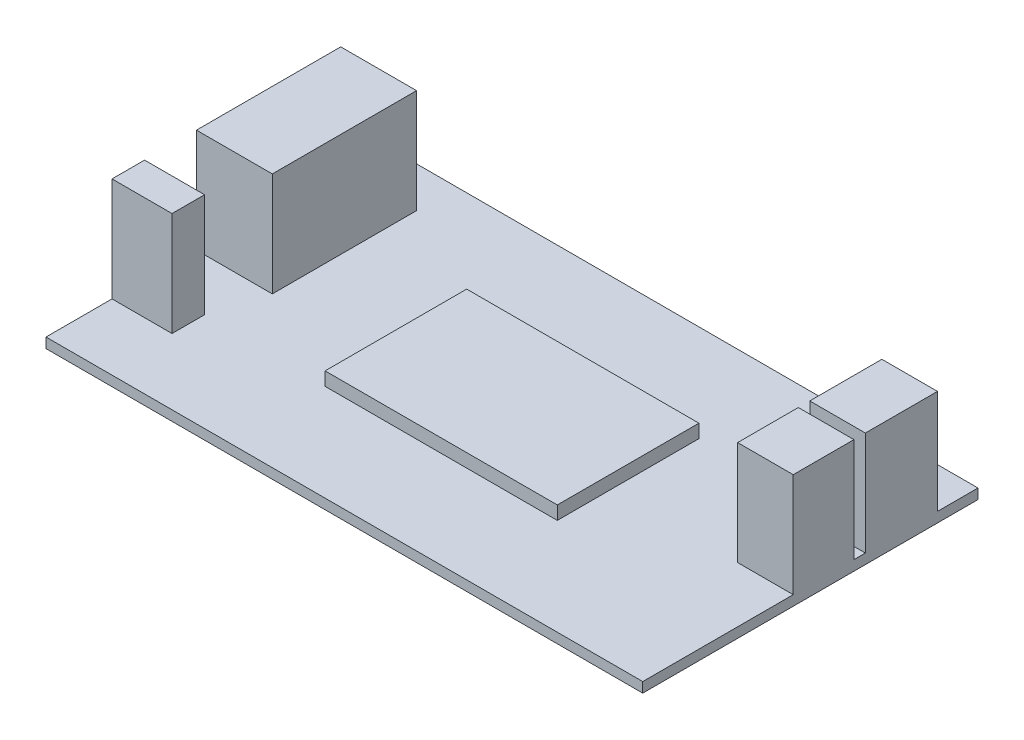
ISO-10303-21;
HEADER;
FILE_DESCRIPTION(('STEP AP214'),'2;1');
FILE_NAME('part.step','',(''),(''),'','','');
FILE_SCHEMA(('AUTOMOTIVE_DESIGN { 1 0 10303 214 1 1 1 1 }'));
ENDSEC;
DATA;
#1=APPLICATION_CONTEXT('core data for automotive mechanical design processes');
#2=APPLICATION_PROTOCOL_DEFINITION('international standard','automotive_design',2000,#1);
#3=PRODUCT_CONTEXT('',#1,'mechanical');
#4=PRODUCT('Part','Part','',(#3));
#5=PRODUCT_RELATED_PRODUCT_CATEGORY('part','',(#4));
#6=PRODUCT_DEFINITION_FORMATION('','',#4);
#7=PRODUCT_DEFINITION_CONTEXT('part definition',#1,'design');
#8=PRODUCT_DEFINITION('design','',#6,#7);
#9=PRODUCT_DEFINITION_SHAPE('','',#8);
#10=(LENGTH_UNIT() NAMED_UNIT(*) SI_UNIT(.MILLI.,.METRE.));
#11=(NAMED_UNIT(*) PLANE_ANGLE_UNIT() SI_UNIT($,.RADIAN.));
#12=(NAMED_UNIT(*) SI_UNIT($,.STERADIAN.) SOLID_ANGLE_UNIT());
#13=UNCERTAINTY_MEASURE_WITH_UNIT(LENGTH_MEASURE(1.E-05),#10,'distance_accuracy_value','');
#14=(GEOMETRIC_REPRESENTATION_CONTEXT(3) GLOBAL_UNCERTAINTY_ASSIGNED_CONTEXT((#13)) GLOBAL_UNIT_ASSIGNED_CONTEXT((#10,
#11,#12)) REPRESENTATION_CONTEXT('',''));
#15=CARTESIAN_POINT('',(0.,0.,0.));
#16=DIRECTION('',(0.,0.,1.));
#17=DIRECTION('',(1.,0.,0.));
#18=AXIS2_PLACEMENT_3D('',#15,#16,#17);
#19=CARTESIAN_POINT('',(0.,1.5,0.));
#20=DIRECTION('',(0.,1.,0.));
#21=DIRECTION('',(0.,0.,1.));
#22=AXIS2_PLACEMENT_3D('',#19,#20,#21);
#23=PLANE('',#22);
#24=DIRECTION('',(0.,0.,1.));
#25=VECTOR('',#24,1.);
#26=CARTESIAN_POINT('',(36.2079849627216,1.5,-6.49382339005333));
#27=LINE('',#26,#25);
#28=CARTESIAN_POINT('',(36.2079849627216,1.5,-6.49382339005333));
#29=VERTEX_POINT('',#28);
#30=CARTESIAN_POINT('',(36.2079849627216,1.5,2.55817285062705));
#31=VERTEX_POINT('',#30);
#32=EDGE_CURVE('E59',#29,#31,#27,.T.);
#33=ORIENTED_EDGE('',*,*,#32,.F.);
#34=DIRECTION('',(-1.,0.,0.));
#35=VECTOR('',#34,1.);
#36=CARTESIAN_POINT('',(44.5,1.5,-6.49382339005333));
#37=LINE('',#36,#35);
#38=CARTESIAN_POINT('',(44.5,1.5,-6.49382339005333));
#39=VERTEX_POINT('',#38);
#40=EDGE_CURVE('E223',#39,#29,#37,.T.);
#41=ORIENTED_EDGE('',*,*,#40,.F.);
#42=DIRECTION('',(0.,0.,-1.));
#43=VECTOR('',#42,1.);
#44=CARTESIAN_POINT('',(44.5,1.5,-25.));
#45=LINE('',#44,#43);
#46=CARTESIAN_POINT('',(44.5,1.5,-8.19927195713806));
#47=VERTEX_POINT('',#46);
#48=EDGE_CURVE('E357',#39,#47,#45,.T.);
#49=ORIENTED_EDGE('',*,*,#48,.T.);
#50=DIRECTION('',(1.,0.,0.));
#51=VECTOR('',#50,1.);
#52=CARTESIAN_POINT('',(44.5,1.5,-8.19927195713805));
#53=LINE('',#52,#51);
#54=CARTESIAN_POINT('',(36.2079849627216,1.5,-8.19927195713805));
#55=VERTEX_POINT('',#54);
#56=EDGE_CURVE('E259',#55,#47,#53,.T.);
#57=ORIENTED_EDGE('',*,*,#56,.F.);
#58=DIRECTION('',(0.,0.,1.));
#59=VECTOR('',#58,1.);
#60=CARTESIAN_POINT('',(36.2079849627216,1.5,-18.9567167649031));
#61=LINE('',#60,#59);
#62=CARTESIAN_POINT('',(36.2079849627216,1.5,-18.9567167649031));
#63=VERTEX_POINT('',#62);
#64=EDGE_CURVE('E268',#63,#55,#61,.T.);
#65=ORIENTED_EDGE('',*,*,#64,.F.);
#66=DIRECTION('',(-1.,0.,0.));
#67=VECTOR('',#66,1.);
#68=CARTESIAN_POINT('',(44.5,1.5,-18.9567167649031));
#69=LINE('',#68,#67);
#70=CARTESIAN_POINT('',(44.5,1.5,-18.9567167649031));
#71=VERTEX_POINT('',#70);
#72=EDGE_CURVE('E254',#71,#63,#69,.T.);
#73=ORIENTED_EDGE('',*,*,#72,.F.);
#74=CARTESIAN_POINT('',(44.5,1.5,-25.));
#75=VERTEX_POINT('',#74);
#76=EDGE_CURVE('E358',#71,#75,#45,.T.);
#77=ORIENTED_EDGE('',*,*,#76,.T.);
#78=DIRECTION('',(-1.,0.,0.));
#79=VECTOR('',#78,1.);
#80=CARTESIAN_POINT('',(-44.5,1.5,-25.));
#81=LINE('',#80,#79);
#82=CARTESIAN_POINT('',(-44.5,1.5,-25.));
#83=VERTEX_POINT('',#82);
#84=EDGE_CURVE('E356',#75,#83,#81,.T.);
#85=ORIENTED_EDGE('',*,*,#84,.T.);
#86=DIRECTION('',(0.,0.,1.));
#87=VECTOR('',#86,1.);
#88=CARTESIAN_POINT('',(-44.5,1.5,-25.));
#89=LINE('',#88,#87);
#90=CARTESIAN_POINT('',(-44.5,1.5,-18.9567167649032));
#91=VERTEX_POINT('',#90);
#92=EDGE_CURVE('E369',#83,#91,#89,.T.);
#93=ORIENTED_EDGE('',*,*,#92,.T.);
#94=DIRECTION('',(-1.,0.,0.));
#95=VECTOR('',#94,1.);
#96=CARTESIAN_POINT('',(-44.5,1.5,-18.9567167649032));
#97=LINE('',#96,#95);
#98=CARTESIAN_POINT('',(-33.1906528824948,1.5,-18.9567167649032));
#99=VERTEX_POINT('',#98);
#100=EDGE_CURVE('E315',#99,#91,#97,.T.);
#101=ORIENTED_EDGE('',*,*,#100,.F.);
#102=DIRECTION('',(0.,0.,-1.));
#103=VECTOR('',#102,1.);
#104=CARTESIAN_POINT('',(-33.1906528824948,1.5,-18.9567167649032));
#105=LINE('',#104,#103);
#106=CARTESIAN_POINT('',(-33.1906528824948,1.5,2.55817285062705));
#107=VERTEX_POINT('',#106);
#108=EDGE_CURVE('E322',#107,#99,#105,.T.);
#109=ORIENTED_EDGE('',*,*,#108,.F.);
#110=DIRECTION('',(1.,0.,0.));
#111=VECTOR('',#110,1.);
#112=CARTESIAN_POINT('',(-44.5,1.5,2.55817285062705));
#113=LINE('',#112,#111);
#114=CARTESIAN_POINT('',(-44.5,1.5,2.55817285062704));
#115=VERTEX_POINT('',#114);
#116=EDGE_CURVE('E310',#115,#107,#113,.T.);
#117=ORIENTED_EDGE('',*,*,#116,.F.);
#118=CARTESIAN_POINT('',(-44.5,1.5,10.2982855781654));
#119=VERTEX_POINT('',#118);
#120=EDGE_CURVE('E366',#115,#119,#89,.T.);
#121=ORIENTED_EDGE('',*,*,#120,.T.);
#122=DIRECTION('',(-1.,0.,0.));
#123=VECTOR('',#122,1.);
#124=CARTESIAN_POINT('',(-44.5,1.5,10.2982855781654));
#125=LINE('',#124,#123);
#126=CARTESIAN_POINT('',(-35.5520432061505,1.5,10.2982855781654));
#127=VERTEX_POINT('',#126);
#128=EDGE_CURVE('E289',#127,#119,#125,.T.);
#129=ORIENTED_EDGE('',*,*,#128,.F.);
#130=DIRECTION('',(0.,0.,-1.));
#131=VECTOR('',#130,1.);
#132=CARTESIAN_POINT('',(-35.5520432061505,1.5,10.2982855781654));
#133=LINE('',#132,#131);
#134=CARTESIAN_POINT('',(-35.5520432061505,1.5,15.1522545767911));
#135=VERTEX_POINT('',#134);
#136=EDGE_CURVE('E297',#135,#127,#133,.T.);
#137=ORIENTED_EDGE('',*,*,#136,.F.);
#138=DIRECTION('',(1.,0.,0.));
#139=VECTOR('',#138,1.);
#140=CARTESIAN_POINT('',(-44.5,1.5,15.1522545767911));
#141=LINE('',#140,#139);
#142=CARTESIAN_POINT('',(-44.5,1.5,15.1522545767911));
#143=VERTEX_POINT('',#142);
#144=EDGE_CURVE('E284',#143,#135,#141,.T.);
#145=ORIENTED_EDGE('',*,*,#144,.F.);
#146=CARTESIAN_POINT('',(-44.5,1.5,25.));
#147=VERTEX_POINT('',#146);
#148=EDGE_CURVE('E37',#143,#147,#89,.T.);
#149=ORIENTED_EDGE('',*,*,#148,.T.);
#150=DIRECTION('',(1.,0.,0.));
#151=VECTOR('',#150,1.);
#152=CARTESIAN_POINT('',(-44.5,1.5,25.));
#153=LINE('',#152,#151);
#154=CARTESIAN_POINT('',(44.5,1.5,25.));
#155=VERTEX_POINT('',#154);
#156=EDGE_CURVE('E361',#147,#155,#153,.T.);
#157=ORIENTED_EDGE('',*,*,#156,.T.);
#158=CARTESIAN_POINT('',(44.5,1.5,2.55817285062705));
#159=VERTEX_POINT('',#158);
#160=EDGE_CURVE('E354',#155,#159,#45,.T.);
#161=ORIENTED_EDGE('',*,*,#160,.T.);
#162=DIRECTION('',(1.,0.,0.));
#163=VECTOR('',#162,1.);
#164=CARTESIAN_POINT('',(44.5,1.5,2.55817285062705));
#165=LINE('',#164,#163);
#166=EDGE_CURVE('E233',#31,#159,#165,.T.);
#167=ORIENTED_EDGE('',*,*,#166,.F.);
#168=EDGE_LOOP('',(#33,#41,#49,#57,#65,#73,#77,#85,#93,#101,#109,#117,#121,#129,#137,#145,#149,
#157,#161,#167));
#169=FACE_BOUND('',#168,.T.);
#170=DIRECTION('',(-1.,0.,0.));
#171=VECTOR('',#170,1.);
#172=CARTESIAN_POINT('',(-17.3168471020499,1.5,-10.5606557137502));
#173=LINE('',#172,#171);
#174=CARTESIAN_POINT('',(17.3168471020499,1.5,-10.5606557137502));
#175=VERTEX_POINT('',#174);
#176=CARTESIAN_POINT('',(-17.3168471020499,1.5,-10.5606557137502));
#177=VERTEX_POINT('',#176);
#178=EDGE_CURVE('E638',#175,#177,#173,.T.);
#179=ORIENTED_EDGE('',*,*,#178,.F.);
#180=DIRECTION('',(0.,0.,-1.));
#181=VECTOR('',#180,1.);
#182=CARTESIAN_POINT('',(17.3168471020499,1.5,-10.5606557137502));
#183=LINE('',#182,#181);
#184=CARTESIAN_POINT('',(17.3168471020499,1.5,10.5606557137502));
#185=VERTEX_POINT('',#184);
#186=EDGE_CURVE('E221',#185,#175,#183,.T.);
#187=ORIENTED_EDGE('',*,*,#186,.F.);
#188=DIRECTION('',(1.,0.,0.));
#189=VECTOR('',#188,1.);
#190=CARTESIAN_POINT('',(-17.3168471020499,1.5,10.5606557137502));
#191=LINE('',#190,#189);
#192=CARTESIAN_POINT('',(-17.3168471020499,1.5,10.5606557137502));
#193=VERTEX_POINT('',#192);
#194=EDGE_CURVE('E217',#193,#185,#191,.T.);
#195=ORIENTED_EDGE('',*,*,#194,.F.);
#196=DIRECTION('',(0.,0.,1.));
#197=VECTOR('',#196,1.);
#198=CARTESIAN_POINT('',(-17.3168471020499,1.5,-10.5606557137502));
#199=LINE('',#198,#197);
#200=EDGE_CURVE('E635',#177,#193,#199,.T.);
#201=ORIENTED_EDGE('',*,*,#200,.F.);
#202=EDGE_LOOP('',(#179,#187,#195,#201));
#203=FACE_BOUND('',#202,.T.);
#204=ADVANCED_FACE('F33',(#169,#203),#23,.T.);
#205=CARTESIAN_POINT('',(44.5,1.5,-25.));
#206=DIRECTION('',(-1.,0.,0.));
#207=DIRECTION('',(0.,0.,1.));
#208=AXIS2_PLACEMENT_3D('',#205,#206,#207);
#209=PLANE('',#208);
#210=DIRECTION('',(0.,0.,-1.));
#211=VECTOR('',#210,1.);
#212=CARTESIAN_POINT('',(44.5,0.,-25.));
#213=LINE('',#212,#211);
#214=CARTESIAN_POINT('',(44.5,0.,25.));
#215=VERTEX_POINT('',#214);
#216=CARTESIAN_POINT('',(44.5,0.,-25.));
#217=VERTEX_POINT('',#216);
#218=EDGE_CURVE('E352',#215,#217,#213,.T.);
#219=ORIENTED_EDGE('',*,*,#218,.T.);
#220=DIRECTION('',(0.,-1.,0.));
#221=VECTOR('',#220,1.);
#222=CARTESIAN_POINT('',(44.5,1.5,-25.));
#223=LINE('',#222,#221);
#224=EDGE_CURVE('E11',#75,#217,#223,.T.);
#225=ORIENTED_EDGE('',*,*,#224,.F.);
#226=ORIENTED_EDGE('',*,*,#76,.F.);
#227=DIRECTION('',(0.,-1.,0.));
#228=VECTOR('',#227,1.);
#229=CARTESIAN_POINT('',(44.5,17.,-18.9567167649031));
#230=LINE('',#229,#228);
#231=CARTESIAN_POINT('',(44.5,17.,-18.9567167649031));
#232=VERTEX_POINT('',#231);
#233=EDGE_CURVE('E281',#232,#71,#230,.T.);
#234=ORIENTED_EDGE('',*,*,#233,.F.);
#235=DIRECTION('',(0.,0.,-1.));
#236=VECTOR('',#235,1.);
#237=CARTESIAN_POINT('',(44.5,17.,-18.9567167649031));
#238=LINE('',#237,#236);
#239=CARTESIAN_POINT('',(44.5,17.,-8.19927195713805));
#240=VERTEX_POINT('',#239);
#241=EDGE_CURVE('E255',#240,#232,#238,.T.);
#242=ORIENTED_EDGE('',*,*,#241,.F.);
#243=DIRECTION('',(0.,-1.,0.));
#244=VECTOR('',#243,1.);
#245=CARTESIAN_POINT('',(44.5,17.,-8.19927195713805));
#246=LINE('',#245,#244);
#247=EDGE_CURVE('E265',#240,#47,#246,.T.);
#248=ORIENTED_EDGE('',*,*,#247,.T.);
#249=ORIENTED_EDGE('',*,*,#48,.F.);
#250=DIRECTION('',(0.,-1.,0.));
#251=VECTOR('',#250,1.);
#252=CARTESIAN_POINT('',(44.5,17.,-6.49382339005333));
#253=LINE('',#252,#251);
#254=CARTESIAN_POINT('',(44.5,17.,-6.49382339005333));
#255=VERTEX_POINT('',#254);
#256=EDGE_CURVE('E251',#255,#39,#253,.T.);
#257=ORIENTED_EDGE('',*,*,#256,.F.);
#258=DIRECTION('',(0.,0.,-1.));
#259=VECTOR('',#258,1.);
#260=CARTESIAN_POINT('',(44.5,17.,-6.49382339005333));
#261=LINE('',#260,#259);
#262=CARTESIAN_POINT('',(44.5,17.,2.55817285062705));
#263=VERTEX_POINT('',#262);
#264=EDGE_CURVE('E229',#263,#255,#261,.T.);
#265=ORIENTED_EDGE('',*,*,#264,.F.);
#266=DIRECTION('',(0.,-1.,0.));
#267=VECTOR('',#266,1.);
#268=CARTESIAN_POINT('',(44.5,17.,2.55817285062705));
#269=LINE('',#268,#267);
#270=EDGE_CURVE('E238',#263,#159,#269,.T.);
#271=ORIENTED_EDGE('',*,*,#270,.T.);
#272=ORIENTED_EDGE('',*,*,#160,.F.);
#273=DIRECTION('',(0.,-1.,0.));
#274=VECTOR('',#273,1.);
#275=CARTESIAN_POINT('',(44.5,1.5,25.));
#276=LINE('',#275,#274);
#277=EDGE_CURVE('E376',#155,#215,#276,.T.);
#278=ORIENTED_EDGE('',*,*,#277,.T.);
#279=EDGE_LOOP('',(#219,#225,#226,#234,#242,#248,#249,#257,#265,#271,#272,#278));
#280=FACE_BOUND('',#279,.T.);
#281=ADVANCED_FACE('F35',(#280),#209,.F.);
#282=CARTESIAN_POINT('',(-44.5,1.5,-25.));
#283=DIRECTION('',(0.,0.,1.));
#284=DIRECTION('',(1.,0.,0.));
#285=AXIS2_PLACEMENT_3D('',#282,#283,#284);
#286=PLANE('',#285);
#287=DIRECTION('',(-1.,0.,0.));
#288=VECTOR('',#287,1.);
#289=CARTESIAN_POINT('',(-44.5,0.,-25.));
#290=LINE('',#289,#288);
#291=CARTESIAN_POINT('',(-44.5,0.,-25.));
#292=VERTEX_POINT('',#291);
#293=EDGE_CURVE('E383',#217,#292,#290,.T.);
#294=ORIENTED_EDGE('',*,*,#293,.T.);
#295=DIRECTION('',(0.,-1.,0.));
#296=VECTOR('',#295,1.);
#297=CARTESIAN_POINT('',(-44.5,1.5,-25.));
#298=LINE('',#297,#296);
#299=EDGE_CURVE('E43',#83,#292,#298,.T.);
#300=ORIENTED_EDGE('',*,*,#299,.F.);
#301=ORIENTED_EDGE('',*,*,#84,.F.);
#302=ORIENTED_EDGE('',*,*,#224,.T.);
#303=EDGE_LOOP('',(#294,#300,#301,#302));
#304=FACE_BOUND('',#303,.T.);
#305=ADVANCED_FACE('F397',(#304),#286,.F.);
#306=CARTESIAN_POINT('',(-44.5,1.5,-25.));
#307=DIRECTION('',(1.,0.,0.));
#308=DIRECTION('',(0.,0.,-1.));
#309=AXIS2_PLACEMENT_3D('',#306,#307,#308);
#310=PLANE('',#309);
#311=DIRECTION('',(0.,0.,1.));
#312=VECTOR('',#311,1.);
#313=CARTESIAN_POINT('',(-44.5,0.,-25.));
#314=LINE('',#313,#312);
#315=CARTESIAN_POINT('',(-44.5,0.,25.));
#316=VERTEX_POINT('',#315);
#317=EDGE_CURVE('E381',#292,#316,#314,.T.);
#318=ORIENTED_EDGE('',*,*,#317,.T.);
#319=DIRECTION('',(0.,-1.,0.));
#320=VECTOR('',#319,1.);
#321=CARTESIAN_POINT('',(-44.5,1.5,25.));
#322=LINE('',#321,#320);
#323=EDGE_CURVE('E373',#147,#316,#322,.T.);
#324=ORIENTED_EDGE('',*,*,#323,.F.);
#325=ORIENTED_EDGE('',*,*,#148,.F.);
#326=DIRECTION('',(0.,-1.,0.));
#327=VECTOR('',#326,1.);
#328=CARTESIAN_POINT('',(-44.5,17.,15.1522545767911));
#329=LINE('',#328,#327);
#330=CARTESIAN_POINT('',(-44.5,17.,15.1522545767911));
#331=VERTEX_POINT('',#330);
#332=EDGE_CURVE('E308',#331,#143,#329,.T.);
#333=ORIENTED_EDGE('',*,*,#332,.F.);
#334=DIRECTION('',(0.,0.,1.));
#335=VECTOR('',#334,1.);
#336=CARTESIAN_POINT('',(-44.5,17.,10.2982855781654));
#337=LINE('',#336,#335);
#338=CARTESIAN_POINT('',(-44.5,17.,10.2982855781654));
#339=VERTEX_POINT('',#338);
#340=EDGE_CURVE('E285',#339,#331,#337,.T.);
#341=ORIENTED_EDGE('',*,*,#340,.F.);
#342=DIRECTION('',(0.,-1.,0.));
#343=VECTOR('',#342,1.);
#344=CARTESIAN_POINT('',(-44.5,17.,10.2982855781654));
#345=LINE('',#344,#343);
#346=EDGE_CURVE('E295',#339,#119,#345,.T.);
#347=ORIENTED_EDGE('',*,*,#346,.T.);
#348=ORIENTED_EDGE('',*,*,#120,.F.);
#349=DIRECTION('',(0.,-1.,0.));
#350=VECTOR('',#349,1.);
#351=CARTESIAN_POINT('',(-44.5,17.,2.55817285062705));
#352=LINE('',#351,#350);
#353=CARTESIAN_POINT('',(-44.5,17.,2.55817285062705));
#354=VERTEX_POINT('',#353);
#355=EDGE_CURVE('E347',#354,#115,#352,.T.);
#356=ORIENTED_EDGE('',*,*,#355,.F.);
#357=DIRECTION('',(0.,0.,1.));
#358=VECTOR('',#357,1.);
#359=CARTESIAN_POINT('',(-44.5,17.,-18.9567167649032));
#360=LINE('',#359,#358);
#361=CARTESIAN_POINT('',(-44.5,17.,-18.9567167649032));
#362=VERTEX_POINT('',#361);
#363=EDGE_CURVE('E311',#362,#354,#360,.T.);
#364=ORIENTED_EDGE('',*,*,#363,.F.);
#365=DIRECTION('',(0.,-1.,0.));
#366=VECTOR('',#365,1.);
#367=CARTESIAN_POINT('',(-44.5,17.,-18.9567167649032));
#368=LINE('',#367,#366);
#369=EDGE_CURVE('E321',#362,#91,#368,.T.);
#370=ORIENTED_EDGE('',*,*,#369,.T.);
#371=ORIENTED_EDGE('',*,*,#92,.F.);
#372=ORIENTED_EDGE('',*,*,#299,.T.);
#373=EDGE_LOOP('',(#318,#324,#325,#333,#341,#347,#348,#356,#364,#370,#371,#372));
#374=FACE_BOUND('',#373,.T.);
#375=ADVANCED_FACE('F441',(#374),#310,.F.);
#376=CARTESIAN_POINT('',(-44.5,1.5,25.));
#377=DIRECTION('',(0.,0.,-1.));
#378=DIRECTION('',(-1.,0.,0.));
#379=AXIS2_PLACEMENT_3D('',#376,#377,#378);
#380=PLANE('',#379);
#381=DIRECTION('',(1.,0.,0.));
#382=VECTOR('',#381,1.);
#383=CARTESIAN_POINT('',(-44.5,0.,25.));
#384=LINE('',#383,#382);
#385=EDGE_CURVE('E379',#316,#215,#384,.T.);
#386=ORIENTED_EDGE('',*,*,#385,.T.);
#387=ORIENTED_EDGE('',*,*,#277,.F.);
#388=ORIENTED_EDGE('',*,*,#156,.F.);
#389=ORIENTED_EDGE('',*,*,#323,.T.);
#390=EDGE_LOOP('',(#386,#387,#388,#389));
#391=FACE_BOUND('',#390,.T.);
#392=ADVANCED_FACE('F438',(#391),#380,.F.);
#393=CARTESIAN_POINT('',(0.,0.,0.));
#394=DIRECTION('',(0.,1.,0.));
#395=DIRECTION('',(0.,0.,1.));
#396=AXIS2_PLACEMENT_3D('',#393,#394,#395);
#397=PLANE('',#396);
#398=ORIENTED_EDGE('',*,*,#218,.F.);
#399=ORIENTED_EDGE('',*,*,#385,.F.);
#400=ORIENTED_EDGE('',*,*,#317,.F.);
#401=ORIENTED_EDGE('',*,*,#293,.F.);
#402=EDGE_LOOP('',(#398,#399,#400,#401));
#403=FACE_BOUND('',#402,.T.);
#404=ADVANCED_FACE('F392',(#403),#397,.F.);
#405=CARTESIAN_POINT('',(-44.5,17.,2.55817285062705));
#406=DIRECTION('',(0.,0.,-1.));
#407=DIRECTION('',(-1.,0.,0.));
#408=AXIS2_PLACEMENT_3D('',#405,#406,#407);
#409=PLANE('',#408);
#410=ORIENTED_EDGE('',*,*,#116,.T.);
#411=DIRECTION('',(0.,-1.,0.));
#412=VECTOR('',#411,1.);
#413=CARTESIAN_POINT('',(-33.1906528824948,17.,2.55817285062705));
#414=LINE('',#413,#412);
#415=CARTESIAN_POINT('',(-33.1906528824948,17.,2.55817285062705));
#416=VERTEX_POINT('',#415);
#417=EDGE_CURVE('E342',#416,#107,#414,.T.);
#418=ORIENTED_EDGE('',*,*,#417,.F.);
#419=DIRECTION('',(1.,0.,0.));
#420=VECTOR('',#419,1.);
#421=CARTESIAN_POINT('',(-44.5,17.,2.55817285062705));
#422=LINE('',#421,#420);
#423=EDGE_CURVE('E314',#354,#416,#422,.T.);
#424=ORIENTED_EDGE('',*,*,#423,.F.);
#425=ORIENTED_EDGE('',*,*,#355,.T.);
#426=EDGE_LOOP('',(#410,#418,#424,#425));
#427=FACE_BOUND('',#426,.T.);
#428=ADVANCED_FACE('F434',(#427),#409,.F.);
#429=CARTESIAN_POINT('',(-33.1906528824948,17.,-18.9567167649032));
#430=DIRECTION('',(-1.,0.,0.));
#431=DIRECTION('',(0.,0.,1.));
#432=AXIS2_PLACEMENT_3D('',#429,#430,#431);
#433=PLANE('',#432);
#434=ORIENTED_EDGE('',*,*,#108,.T.);
#435=DIRECTION('',(0.,-1.,0.));
#436=VECTOR('',#435,1.);
#437=CARTESIAN_POINT('',(-33.1906528824948,17.,-18.9567167649032));
#438=LINE('',#437,#436);
#439=CARTESIAN_POINT('',(-33.1906528824948,17.,-18.9567167649032));
#440=VERTEX_POINT('',#439);
#441=EDGE_CURVE('E327',#440,#99,#438,.T.);
#442=ORIENTED_EDGE('',*,*,#441,.F.);
#443=DIRECTION('',(0.,0.,-1.));
#444=VECTOR('',#443,1.);
#445=CARTESIAN_POINT('',(-33.1906528824948,17.,-18.9567167649032));
#446=LINE('',#445,#444);
#447=EDGE_CURVE('E317',#416,#440,#446,.T.);
#448=ORIENTED_EDGE('',*,*,#447,.F.);
#449=ORIENTED_EDGE('',*,*,#417,.T.);
#450=EDGE_LOOP('',(#434,#442,#448,#449));
#451=FACE_BOUND('',#450,.T.);
#452=ADVANCED_FACE('F467',(#451),#433,.F.);
#453=CARTESIAN_POINT('',(-44.5,17.,-18.9567167649032));
#454=DIRECTION('',(0.,0.,1.));
#455=DIRECTION('',(1.,0.,0.));
#456=AXIS2_PLACEMENT_3D('',#453,#454,#455);
#457=PLANE('',#456);
#458=ORIENTED_EDGE('',*,*,#100,.T.);
#459=ORIENTED_EDGE('',*,*,#369,.F.);
#460=DIRECTION('',(-1.,0.,0.));
#461=VECTOR('',#460,1.);
#462=CARTESIAN_POINT('',(-44.5,17.,-18.9567167649032));
#463=LINE('',#462,#461);
#464=EDGE_CURVE('E319',#440,#362,#463,.T.);
#465=ORIENTED_EDGE('',*,*,#464,.F.);
#466=ORIENTED_EDGE('',*,*,#441,.T.);
#467=EDGE_LOOP('',(#458,#459,#465,#466));
#468=FACE_BOUND('',#467,.T.);
#469=ADVANCED_FACE('F474',(#468),#457,.F.);
#470=CARTESIAN_POINT('',(0.,17.,0.));
#471=DIRECTION('',(0.,1.,0.));
#472=DIRECTION('',(0.,0.,1.));
#473=AXIS2_PLACEMENT_3D('',#470,#471,#472);
#474=PLANE('',#473);
#475=ORIENTED_EDGE('',*,*,#363,.T.);
#476=ORIENTED_EDGE('',*,*,#423,.T.);
#477=ORIENTED_EDGE('',*,*,#447,.T.);
#478=ORIENTED_EDGE('',*,*,#464,.T.);
#479=EDGE_LOOP('',(#475,#476,#477,#478));
#480=FACE_BOUND('',#479,.T.);
#481=ADVANCED_FACE('F480',(#480),#474,.T.);
#482=CARTESIAN_POINT('',(-44.5,17.,15.1522545767911));
#483=DIRECTION('',(0.,0.,-1.));
#484=DIRECTION('',(-1.,0.,0.));
#485=AXIS2_PLACEMENT_3D('',#482,#483,#484);
#486=PLANE('',#485);
#487=ORIENTED_EDGE('',*,*,#144,.T.);
#488=DIRECTION('',(0.,-1.,0.));
#489=VECTOR('',#488,1.);
#490=CARTESIAN_POINT('',(-35.5520432061505,17.,15.1522545767911));
#491=LINE('',#490,#489);
#492=CARTESIAN_POINT('',(-35.5520432061505,17.,15.1522545767911));
#493=VERTEX_POINT('',#492);
#494=EDGE_CURVE('E305',#493,#135,#491,.T.);
#495=ORIENTED_EDGE('',*,*,#494,.F.);
#496=DIRECTION('',(1.,0.,0.));
#497=VECTOR('',#496,1.);
#498=CARTESIAN_POINT('',(-44.5,17.,15.1522545767911));
#499=LINE('',#498,#497);
#500=EDGE_CURVE('E288',#331,#493,#499,.T.);
#501=ORIENTED_EDGE('',*,*,#500,.F.);
#502=ORIENTED_EDGE('',*,*,#332,.T.);
#503=EDGE_LOOP('',(#487,#495,#501,#502));
#504=FACE_BOUND('',#503,.T.);
#505=ADVANCED_FACE('F487',(#504),#486,.F.);
#506=CARTESIAN_POINT('',(-35.5520432061505,17.,10.2982855781654));
#507=DIRECTION('',(-1.,0.,0.));
#508=DIRECTION('',(0.,0.,1.));
#509=AXIS2_PLACEMENT_3D('',#506,#507,#508);
#510=PLANE('',#509);
#511=ORIENTED_EDGE('',*,*,#136,.T.);
#512=DIRECTION('',(0.,-1.,0.));
#513=VECTOR('',#512,1.);
#514=CARTESIAN_POINT('',(-35.5520432061505,17.,10.2982855781654));
#515=LINE('',#514,#513);
#516=CARTESIAN_POINT('',(-35.5520432061505,17.,10.2982855781654));
#517=VERTEX_POINT('',#516);
#518=EDGE_CURVE('E303',#517,#127,#515,.T.);
#519=ORIENTED_EDGE('',*,*,#518,.F.);
#520=DIRECTION('',(0.,0.,-1.));
#521=VECTOR('',#520,1.);
#522=CARTESIAN_POINT('',(-35.5520432061505,17.,10.2982855781654));
#523=LINE('',#522,#521);
#524=EDGE_CURVE('E291',#493,#517,#523,.T.);
#525=ORIENTED_EDGE('',*,*,#524,.F.);
#526=ORIENTED_EDGE('',*,*,#494,.T.);
#527=EDGE_LOOP('',(#511,#519,#525,#526));
#528=FACE_BOUND('',#527,.T.);
#529=ADVANCED_FACE('F495',(#528),#510,.F.);
#530=CARTESIAN_POINT('',(-44.5,17.,10.2982855781654));
#531=DIRECTION('',(0.,0.,1.));
#532=DIRECTION('',(1.,0.,0.));
#533=AXIS2_PLACEMENT_3D('',#530,#531,#532);
#534=PLANE('',#533);
#535=ORIENTED_EDGE('',*,*,#128,.T.);
#536=ORIENTED_EDGE('',*,*,#346,.F.);
#537=DIRECTION('',(-1.,0.,0.));
#538=VECTOR('',#537,1.);
#539=CARTESIAN_POINT('',(-44.5,17.,10.2982855781654));
#540=LINE('',#539,#538);
#541=EDGE_CURVE('E293',#517,#339,#540,.T.);
#542=ORIENTED_EDGE('',*,*,#541,.F.);
#543=ORIENTED_EDGE('',*,*,#518,.T.);
#544=EDGE_LOOP('',(#535,#536,#542,#543));
#545=FACE_BOUND('',#544,.T.);
#546=ADVANCED_FACE('F424',(#545),#534,.F.);
#547=CARTESIAN_POINT('',(0.,17.,0.));
#548=DIRECTION('',(0.,1.,0.));
#549=DIRECTION('',(0.,0.,1.));
#550=AXIS2_PLACEMENT_3D('',#547,#548,#549);
#551=PLANE('',#550);
#552=ORIENTED_EDGE('',*,*,#340,.T.);
#553=ORIENTED_EDGE('',*,*,#500,.T.);
#554=ORIENTED_EDGE('',*,*,#524,.T.);
#555=ORIENTED_EDGE('',*,*,#541,.T.);
#556=EDGE_LOOP('',(#552,#553,#554,#555));
#557=FACE_BOUND('',#556,.T.);
#558=ADVANCED_FACE('F417',(#557),#551,.T.);
#559=CARTESIAN_POINT('',(44.5,17.,-18.9567167649031));
#560=DIRECTION('',(0.,0.,1.));
#561=DIRECTION('',(1.,0.,0.));
#562=AXIS2_PLACEMENT_3D('',#559,#560,#561);
#563=PLANE('',#562);
#564=ORIENTED_EDGE('',*,*,#72,.T.);
#565=DIRECTION('',(0.,-1.,0.));
#566=VECTOR('',#565,1.);
#567=CARTESIAN_POINT('',(36.2079849627216,17.,-18.9567167649031));
#568=LINE('',#567,#566);
#569=CARTESIAN_POINT('',(36.2079849627216,17.,-18.9567167649031));
#570=VERTEX_POINT('',#569);
#571=EDGE_CURVE('E278',#570,#63,#568,.T.);
#572=ORIENTED_EDGE('',*,*,#571,.F.);
#573=DIRECTION('',(-1.,0.,0.));
#574=VECTOR('',#573,1.);
#575=CARTESIAN_POINT('',(44.5,17.,-18.9567167649031));
#576=LINE('',#575,#574);
#577=EDGE_CURVE('E258',#232,#570,#576,.T.);
#578=ORIENTED_EDGE('',*,*,#577,.F.);
#579=ORIENTED_EDGE('',*,*,#233,.T.);
#580=EDGE_LOOP('',(#564,#572,#578,#579));
#581=FACE_BOUND('',#580,.T.);
#582=ADVANCED_FACE('F415',(#581),#563,.F.);
#583=CARTESIAN_POINT('',(36.2079849627216,17.,-18.9567167649031));
#584=DIRECTION('',(1.,0.,0.));
#585=DIRECTION('',(0.,0.,-1.));
#586=AXIS2_PLACEMENT_3D('',#583,#584,#585);
#587=PLANE('',#586);
#588=ORIENTED_EDGE('',*,*,#64,.T.);
#589=DIRECTION('',(0.,-1.,0.));
#590=VECTOR('',#589,1.);
#591=CARTESIAN_POINT('',(36.2079849627216,17.,-8.19927195713805));
#592=LINE('',#591,#590);
#593=CARTESIAN_POINT('',(36.2079849627216,17.,-8.19927195713805));
#594=VERTEX_POINT('',#593);
#595=EDGE_CURVE('E275',#594,#55,#592,.T.);
#596=ORIENTED_EDGE('',*,*,#595,.F.);
#597=DIRECTION('',(0.,0.,1.));
#598=VECTOR('',#597,1.);
#599=CARTESIAN_POINT('',(36.2079849627216,17.,-18.9567167649031));
#600=LINE('',#599,#598);
#601=EDGE_CURVE('E261',#570,#594,#600,.T.);
#602=ORIENTED_EDGE('',*,*,#601,.F.);
#603=ORIENTED_EDGE('',*,*,#571,.T.);
#604=EDGE_LOOP('',(#588,#596,#602,#603));
#605=FACE_BOUND('',#604,.T.);
#606=ADVANCED_FACE('F413',(#605),#587,.F.);
#607=CARTESIAN_POINT('',(44.5,17.,-8.19927195713805));
#608=DIRECTION('',(0.,0.,-1.));
#609=DIRECTION('',(-1.,0.,0.));
#610=AXIS2_PLACEMENT_3D('',#607,#608,#609);
#611=PLANE('',#610);
#612=ORIENTED_EDGE('',*,*,#56,.T.);
#613=ORIENTED_EDGE('',*,*,#247,.F.);
#614=DIRECTION('',(1.,0.,0.));
#615=VECTOR('',#614,1.);
#616=CARTESIAN_POINT('',(44.5,17.,-8.19927195713805));
#617=LINE('',#616,#615);
#618=EDGE_CURVE('E263',#594,#240,#617,.T.);
#619=ORIENTED_EDGE('',*,*,#618,.F.);
#620=ORIENTED_EDGE('',*,*,#595,.T.);
#621=EDGE_LOOP('',(#612,#613,#619,#620));
#622=FACE_BOUND('',#621,.T.);
#623=ADVANCED_FACE('F404',(#622),#611,.F.);
#624=CARTESIAN_POINT('',(0.,17.,0.));
#625=DIRECTION('',(0.,-1.,0.));
#626=DIRECTION('',(0.,0.,-1.));
#627=AXIS2_PLACEMENT_3D('',#624,#625,#626);
#628=PLANE('',#627);
#629=ORIENTED_EDGE('',*,*,#241,.T.);
#630=ORIENTED_EDGE('',*,*,#577,.T.);
#631=ORIENTED_EDGE('',*,*,#601,.T.);
#632=ORIENTED_EDGE('',*,*,#618,.T.);
#633=EDGE_LOOP('',(#629,#630,#631,#632));
#634=FACE_BOUND('',#633,.T.);
#635=ADVANCED_FACE('F409',(#634),#628,.F.);
#636=CARTESIAN_POINT('',(44.5,17.,-6.49382339005333));
#637=DIRECTION('',(0.,0.,1.));
#638=DIRECTION('',(1.,0.,0.));
#639=AXIS2_PLACEMENT_3D('',#636,#637,#638);
#640=PLANE('',#639);
#641=ORIENTED_EDGE('',*,*,#40,.T.);
#642=DIRECTION('',(0.,-1.,0.));
#643=VECTOR('',#642,1.);
#644=CARTESIAN_POINT('',(36.2079849627216,17.,-6.49382339005333));
#645=LINE('',#644,#643);
#646=CARTESIAN_POINT('',(36.2079849627216,17.,-6.49382339005333));
#647=VERTEX_POINT('',#646);
#648=EDGE_CURVE('E248',#647,#29,#645,.T.);
#649=ORIENTED_EDGE('',*,*,#648,.F.);
#650=DIRECTION('',(-1.,0.,0.));
#651=VECTOR('',#650,1.);
#652=CARTESIAN_POINT('',(44.5,17.,-6.49382339005333));
#653=LINE('',#652,#651);
#654=EDGE_CURVE('E232',#255,#647,#653,.T.);
#655=ORIENTED_EDGE('',*,*,#654,.F.);
#656=ORIENTED_EDGE('',*,*,#256,.T.);
#657=EDGE_LOOP('',(#641,#649,#655,#656));
#658=FACE_BOUND('',#657,.T.);
#659=ADVANCED_FACE('F542',(#658),#640,.F.);
#660=CARTESIAN_POINT('',(36.2079849627216,17.,-6.49382339005333));
#661=DIRECTION('',(1.,0.,0.));
#662=DIRECTION('',(0.,0.,-1.));
#663=AXIS2_PLACEMENT_3D('',#660,#661,#662);
#664=PLANE('',#663);
#665=ORIENTED_EDGE('',*,*,#32,.T.);
#666=DIRECTION('',(0.,-1.,0.));
#667=VECTOR('',#666,1.);
#668=CARTESIAN_POINT('',(36.2079849627216,17.,2.55817285062705));
#669=LINE('',#668,#667);
#670=CARTESIAN_POINT('',(36.2079849627216,17.,2.55817285062705));
#671=VERTEX_POINT('',#670);
#672=EDGE_CURVE('E245',#671,#31,#669,.T.);
#673=ORIENTED_EDGE('',*,*,#672,.F.);
#674=DIRECTION('',(0.,0.,1.));
#675=VECTOR('',#674,1.);
#676=CARTESIAN_POINT('',(36.2079849627216,17.,-6.49382339005333));
#677=LINE('',#676,#675);
#678=EDGE_CURVE('E235',#647,#671,#677,.T.);
#679=ORIENTED_EDGE('',*,*,#678,.F.);
#680=ORIENTED_EDGE('',*,*,#648,.T.);
#681=EDGE_LOOP('',(#665,#673,#679,#680));
#682=FACE_BOUND('',#681,.T.);
#683=ADVANCED_FACE('F551',(#682),#664,.F.);
#684=CARTESIAN_POINT('',(44.5,17.,2.55817285062705));
#685=DIRECTION('',(0.,0.,-1.));
#686=DIRECTION('',(-1.,0.,0.));
#687=AXIS2_PLACEMENT_3D('',#684,#685,#686);
#688=PLANE('',#687);
#689=ORIENTED_EDGE('',*,*,#166,.T.);
#690=ORIENTED_EDGE('',*,*,#270,.F.);
#691=DIRECTION('',(1.,0.,0.));
#692=VECTOR('',#691,1.);
#693=CARTESIAN_POINT('',(44.5,17.,2.55817285062705));
#694=LINE('',#693,#692);
#695=EDGE_CURVE('E237',#671,#263,#694,.T.);
#696=ORIENTED_EDGE('',*,*,#695,.F.);
#697=ORIENTED_EDGE('',*,*,#672,.T.);
#698=EDGE_LOOP('',(#689,#690,#696,#697));
#699=FACE_BOUND('',#698,.T.);
#700=ADVANCED_FACE('F561',(#699),#688,.F.);
#701=CARTESIAN_POINT('',(0.,17.,0.));
#702=DIRECTION('',(0.,-1.,0.));
#703=DIRECTION('',(0.,0.,-1.));
#704=AXIS2_PLACEMENT_3D('',#701,#702,#703);
#705=PLANE('',#704);
#706=ORIENTED_EDGE('',*,*,#264,.T.);
#707=ORIENTED_EDGE('',*,*,#654,.T.);
#708=ORIENTED_EDGE('',*,*,#678,.T.);
#709=ORIENTED_EDGE('',*,*,#695,.T.);
#710=EDGE_LOOP('',(#706,#707,#708,#709));
#711=FACE_BOUND('',#710,.T.);
#712=ADVANCED_FACE('F571',(#711),#705,.F.);
#713=CARTESIAN_POINT('',(17.3168471020499,3.5,-10.5606557137502));
#714=DIRECTION('',(-1.,0.,0.));
#715=DIRECTION('',(0.,0.,1.));
#716=AXIS2_PLACEMENT_3D('',#713,#714,#715);
#717=PLANE('',#716);
#718=ORIENTED_EDGE('',*,*,#186,.T.);
#719=DIRECTION('',(0.,-1.,0.));
#720=VECTOR('',#719,1.);
#721=CARTESIAN_POINT('',(17.3168471020499,3.5,-10.5606557137502));
#722=LINE('',#721,#720);
#723=CARTESIAN_POINT('',(17.3168471020499,3.5,-10.5606557137502));
#724=VERTEX_POINT('',#723);
#725=EDGE_CURVE('E202',#724,#175,#722,.T.);
#726=ORIENTED_EDGE('',*,*,#725,.F.);
#727=DIRECTION('',(0.,0.,-1.));
#728=VECTOR('',#727,1.);
#729=CARTESIAN_POINT('',(17.3168471020499,3.5,-10.5606557137502));
#730=LINE('',#729,#728);
#731=CARTESIAN_POINT('',(17.3168471020499,3.5,10.5606557137502));
#732=VERTEX_POINT('',#731);
#733=EDGE_CURVE('E209',#732,#724,#730,.T.);
#734=ORIENTED_EDGE('',*,*,#733,.F.);
#735=DIRECTION('',(0.,-1.,0.));
#736=VECTOR('',#735,1.);
#737=CARTESIAN_POINT('',(17.3168471020499,3.5,10.5606557137502));
#738=LINE('',#737,#736);
#739=EDGE_CURVE('E633',#732,#185,#738,.T.);
#740=ORIENTED_EDGE('',*,*,#739,.T.);
#741=EDGE_LOOP('',(#718,#726,#734,#740));
#742=FACE_BOUND('',#741,.T.);
#743=ADVANCED_FACE('F219',(#742),#717,.F.);
#744=CARTESIAN_POINT('',(-17.3168471020499,3.5,-10.5606557137502));
#745=DIRECTION('',(0.,0.,1.));
#746=DIRECTION('',(1.,0.,0.));
#747=AXIS2_PLACEMENT_3D('',#744,#745,#746);
#748=PLANE('',#747);
#749=ORIENTED_EDGE('',*,*,#178,.T.);
#750=DIRECTION('',(0.,-1.,0.));
#751=VECTOR('',#750,1.);
#752=CARTESIAN_POINT('',(-17.3168471020499,3.5,-10.5606557137502));
#753=LINE('',#752,#751);
#754=CARTESIAN_POINT('',(-17.3168471020499,3.5,-10.5606557137502));
#755=VERTEX_POINT('',#754);
#756=EDGE_CURVE('E205',#755,#177,#753,.T.);
#757=ORIENTED_EDGE('',*,*,#756,.F.);
#758=DIRECTION('',(-1.,0.,0.));
#759=VECTOR('',#758,1.);
#760=CARTESIAN_POINT('',(-17.3168471020499,3.5,-10.5606557137502));
#761=LINE('',#760,#759);
#762=EDGE_CURVE('E198',#724,#755,#761,.T.);
#763=ORIENTED_EDGE('',*,*,#762,.F.);
#764=ORIENTED_EDGE('',*,*,#725,.T.);
#765=EDGE_LOOP('',(#749,#757,#763,#764));
#766=FACE_BOUND('',#765,.T.);
#767=ADVANCED_FACE('F200',(#766),#748,.F.);
#768=CARTESIAN_POINT('',(-17.3168471020499,3.5,-10.5606557137502));
#769=DIRECTION('',(1.,0.,0.));
#770=DIRECTION('',(0.,0.,-1.));
#771=AXIS2_PLACEMENT_3D('',#768,#769,#770);
#772=PLANE('',#771);
#773=ORIENTED_EDGE('',*,*,#200,.T.);
#774=DIRECTION('',(0.,-1.,0.));
#775=VECTOR('',#774,1.);
#776=CARTESIAN_POINT('',(-17.3168471020499,3.5,10.5606557137502));
#777=LINE('',#776,#775);
#778=CARTESIAN_POINT('',(-17.3168471020499,3.5,10.5606557137502));
#779=VERTEX_POINT('',#778);
#780=EDGE_CURVE('E51',#779,#193,#777,.T.);
#781=ORIENTED_EDGE('',*,*,#780,.F.);
#782=DIRECTION('',(0.,0.,1.));
#783=VECTOR('',#782,1.);
#784=CARTESIAN_POINT('',(-17.3168471020499,3.5,-10.5606557137502));
#785=LINE('',#784,#783);
#786=EDGE_CURVE('E208',#755,#779,#785,.T.);
#787=ORIENTED_EDGE('',*,*,#786,.F.);
#788=ORIENTED_EDGE('',*,*,#756,.T.);
#789=EDGE_LOOP('',(#773,#781,#787,#788));
#790=FACE_BOUND('',#789,.T.);
#791=ADVANCED_FACE('F602',(#790),#772,.F.);
#792=CARTESIAN_POINT('',(-17.3168471020499,3.5,10.5606557137502));
#793=DIRECTION('',(0.,0.,-1.));
#794=DIRECTION('',(-1.,0.,0.));
#795=AXIS2_PLACEMENT_3D('',#792,#793,#794);
#796=PLANE('',#795);
#797=ORIENTED_EDGE('',*,*,#194,.T.);
#798=ORIENTED_EDGE('',*,*,#739,.F.);
#799=DIRECTION('',(1.,0.,0.));
#800=VECTOR('',#799,1.);
#801=CARTESIAN_POINT('',(-17.3168471020499,3.5,10.5606557137502));
#802=LINE('',#801,#800);
#803=EDGE_CURVE('E213',#779,#732,#802,.T.);
#804=ORIENTED_EDGE('',*,*,#803,.F.);
#805=ORIENTED_EDGE('',*,*,#780,.T.);
#806=EDGE_LOOP('',(#797,#798,#804,#805));
#807=FACE_BOUND('',#806,.T.);
#808=ADVANCED_FACE('F611',(#807),#796,.F.);
#809=CARTESIAN_POINT('',(0.,3.5,0.));
#810=DIRECTION('',(0.,1.,0.));
#811=DIRECTION('',(0.,0.,1.));
#812=AXIS2_PLACEMENT_3D('',#809,#810,#811);
#813=PLANE('',#812);
#814=ORIENTED_EDGE('',*,*,#733,.T.);
#815=ORIENTED_EDGE('',*,*,#762,.T.);
#816=ORIENTED_EDGE('',*,*,#786,.T.);
#817=ORIENTED_EDGE('',*,*,#803,.T.);
#818=EDGE_LOOP('',(#814,#815,#816,#817));
#819=FACE_BOUND('',#818,.T.);
#820=ADVANCED_FACE('F212',(#819),#813,.T.);
#821=CLOSED_SHELL('',(#204,#281,#305,#375,#392,#404,#428,#452,#469,#481,#505,#529,#546,#558,
#582,#606,#623,#635,#659,#683,#700,#712,#743,#767,#791,#808,#820));
#822=MANIFOLD_SOLID_BREP('B2',#821);
#823=ADVANCED_BREP_SHAPE_REPRESENTATION('',(#18,#822),#14);
#824=SHAPE_DEFINITION_REPRESENTATION(#9,#823);
ENDSEC;
END-ISO-10303-21;
